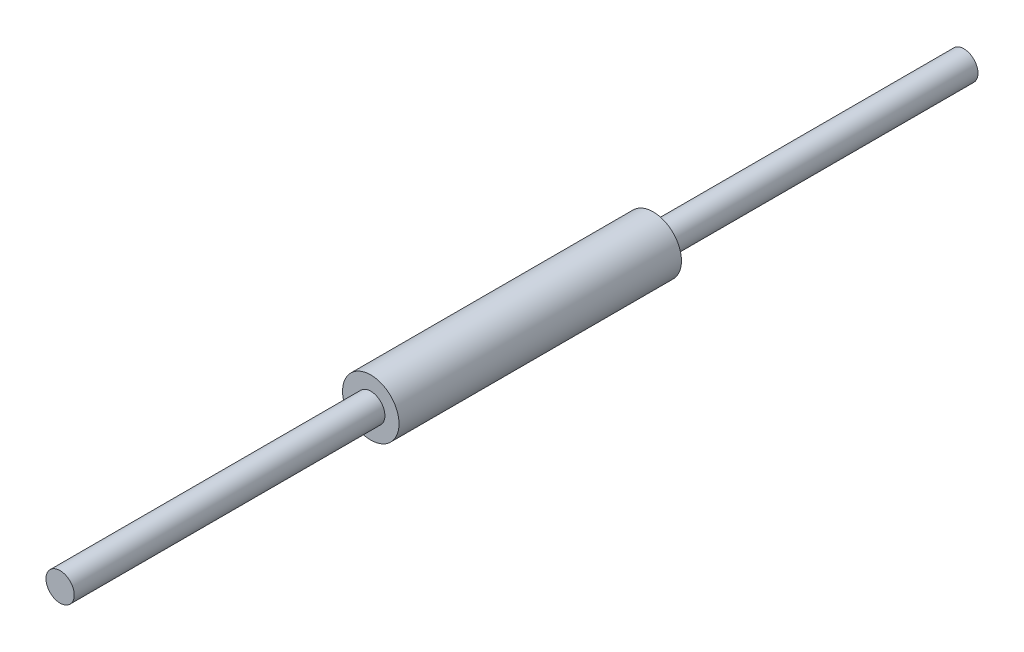
ISO-10303-21;
HEADER;
FILE_DESCRIPTION(('STEP AP214'),'2;1');
FILE_NAME('part.step','',(''),(''),'','','');
FILE_SCHEMA(('AUTOMOTIVE_DESIGN { 1 0 10303 214 1 1 1 1 }'));
ENDSEC;
DATA;
#1=APPLICATION_CONTEXT('core data for automotive mechanical design processes');
#2=APPLICATION_PROTOCOL_DEFINITION('international standard','automotive_design',2000,#1);
#3=PRODUCT_CONTEXT('',#1,'mechanical');
#4=PRODUCT('Part','Part','',(#3));
#5=PRODUCT_RELATED_PRODUCT_CATEGORY('part','',(#4));
#6=PRODUCT_DEFINITION_FORMATION('','',#4);
#7=PRODUCT_DEFINITION_CONTEXT('part definition',#1,'design');
#8=PRODUCT_DEFINITION('design','',#6,#7);
#9=PRODUCT_DEFINITION_SHAPE('','',#8);
#10=(LENGTH_UNIT() NAMED_UNIT(*) SI_UNIT(.MILLI.,.METRE.));
#11=(NAMED_UNIT(*) PLANE_ANGLE_UNIT() SI_UNIT($,.RADIAN.));
#12=(NAMED_UNIT(*) SI_UNIT($,.STERADIAN.) SOLID_ANGLE_UNIT());
#13=UNCERTAINTY_MEASURE_WITH_UNIT(LENGTH_MEASURE(1.E-05),#10,'distance_accuracy_value','');
#14=(GEOMETRIC_REPRESENTATION_CONTEXT(3) GLOBAL_UNCERTAINTY_ASSIGNED_CONTEXT((#13)) GLOBAL_UNIT_ASSIGNED_CONTEXT((#10,
#11,#12)) REPRESENTATION_CONTEXT('',''));
#15=CARTESIAN_POINT('',(0.,0.,0.));
#16=DIRECTION('',(0.,0.,1.));
#17=DIRECTION('',(1.,0.,0.));
#18=AXIS2_PLACEMENT_3D('',#15,#16,#17);
#19=CARTESIAN_POINT('',(0.,0.,125.));
#20=DIRECTION('',(0.,0.,-1.));
#21=DIRECTION('',(-1.,0.,0.));
#22=AXIS2_PLACEMENT_3D('',#19,#20,#21);
#23=CYLINDRICAL_SURFACE('',#22,25.);
#24=CARTESIAN_POINT('',(0.,0.,125.));
#25=DIRECTION('',(0.,0.,1.));
#26=DIRECTION('',(1.,0.,0.));
#27=AXIS2_PLACEMENT_3D('',#24,#25,#26);
#28=CIRCLE('',#27,25.);
#29=CARTESIAN_POINT('',(25.,0.,125.));
#30=VERTEX_POINT('',#29);
#31=EDGE_CURVE('E47',#30,#30,#28,.T.);
#32=ORIENTED_EDGE('',*,*,#31,.F.);
#33=EDGE_LOOP('',(#32));
#34=FACE_BOUND('',#33,.T.);
#35=CARTESIAN_POINT('',(0.,0.,-125.));
#36=DIRECTION('',(0.,0.,1.));
#37=DIRECTION('',(1.,0.,0.));
#38=AXIS2_PLACEMENT_3D('',#35,#36,#37);
#39=CIRCLE('',#38,25.);
#40=CARTESIAN_POINT('',(25.,0.,-125.));
#41=VERTEX_POINT('',#40);
#42=EDGE_CURVE('E51',#41,#41,#39,.T.);
#43=ORIENTED_EDGE('',*,*,#42,.T.);
#44=EDGE_LOOP('',(#43));
#45=FACE_BOUND('',#44,.T.);
#46=ADVANCED_FACE('F41',(#34,#45),#23,.T.);
#47=CARTESIAN_POINT('',(0.,0.,125.));
#48=DIRECTION('',(0.,0.,1.));
#49=DIRECTION('',(1.,0.,0.));
#50=AXIS2_PLACEMENT_3D('',#47,#48,#49);
#51=PLANE('',#50);
#52=CARTESIAN_POINT('',(0.,0.,125.));
#53=DIRECTION('',(0.,0.,1.));
#54=DIRECTION('',(1.,0.,0.));
#55=AXIS2_PLACEMENT_3D('',#52,#53,#54);
#56=CIRCLE('',#55,12.5);
#57=CARTESIAN_POINT('',(12.5,0.,125.));
#58=VERTEX_POINT('',#57);
#59=EDGE_CURVE('E56',#58,#58,#56,.F.);
#60=ORIENTED_EDGE('',*,*,#59,.T.);
#61=EDGE_LOOP('',(#60));
#62=FACE_BOUND('',#61,.T.);
#63=ORIENTED_EDGE('',*,*,#31,.T.);
#64=EDGE_LOOP('',(#63));
#65=FACE_BOUND('',#64,.T.);
#66=ADVANCED_FACE('F85',(#62,#65),#51,.T.);
#67=CARTESIAN_POINT('',(0.,0.,-125.));
#68=DIRECTION('',(0.,0.,1.));
#69=DIRECTION('',(1.,0.,0.));
#70=AXIS2_PLACEMENT_3D('',#67,#68,#69);
#71=PLANE('',#70);
#72=CARTESIAN_POINT('',(0.,0.,-125.));
#73=DIRECTION('',(0.,0.,1.));
#74=DIRECTION('',(1.,0.,0.));
#75=AXIS2_PLACEMENT_3D('',#72,#73,#74);
#76=CIRCLE('',#75,12.5);
#77=CARTESIAN_POINT('',(12.5,0.,-125.));
#78=VERTEX_POINT('',#77);
#79=EDGE_CURVE('E10',#78,#78,#76,.F.);
#80=ORIENTED_EDGE('',*,*,#79,.F.);
#81=EDGE_LOOP('',(#80));
#82=FACE_BOUND('',#81,.T.);
#83=ORIENTED_EDGE('',*,*,#42,.F.);
#84=EDGE_LOOP('',(#83));
#85=FACE_BOUND('',#84,.T.);
#86=ADVANCED_FACE('F90',(#82,#85),#71,.F.);
#87=CARTESIAN_POINT('',(0.,0.,-400.));
#88=DIRECTION('',(0.,0.,1.));
#89=DIRECTION('',(1.,0.,0.));
#90=AXIS2_PLACEMENT_3D('',#87,#88,#89);
#91=PLANE('',#90);
#92=CARTESIAN_POINT('',(0.,0.,-400.));
#93=DIRECTION('',(0.,0.,1.));
#94=DIRECTION('',(1.,0.,0.));
#95=AXIS2_PLACEMENT_3D('',#92,#93,#94);
#96=CIRCLE('',#95,12.5);
#97=CARTESIAN_POINT('',(12.5,0.,-400.));
#98=VERTEX_POINT('',#97);
#99=EDGE_CURVE('E61',#98,#98,#96,.T.);
#100=ORIENTED_EDGE('',*,*,#99,.F.);
#101=EDGE_LOOP('',(#100));
#102=FACE_BOUND('',#101,.T.);
#103=ADVANCED_FACE('F79',(#102),#91,.F.);
#104=CARTESIAN_POINT('',(0.,0.,400.));
#105=DIRECTION('',(0.,0.,-1.));
#106=DIRECTION('',(-1.,0.,0.));
#107=AXIS2_PLACEMENT_3D('',#104,#105,#106);
#108=CYLINDRICAL_SURFACE('',#107,12.5);
#109=ORIENTED_EDGE('',*,*,#99,.T.);
#110=EDGE_LOOP('',(#109));
#111=FACE_BOUND('',#110,.T.);
#112=ORIENTED_EDGE('',*,*,#79,.T.);
#113=EDGE_LOOP('',(#112));
#114=FACE_BOUND('',#113,.T.);
#115=ADVANCED_FACE('F71',(#111,#114),#108,.T.);
#116=ORIENTED_EDGE('',*,*,#59,.F.);
#117=EDGE_LOOP('',(#116));
#118=FACE_BOUND('',#117,.T.);
#119=CARTESIAN_POINT('',(0.,0.,400.));
#120=DIRECTION('',(0.,0.,1.));
#121=DIRECTION('',(1.,0.,0.));
#122=AXIS2_PLACEMENT_3D('',#119,#120,#121);
#123=CIRCLE('',#122,12.5);
#124=CARTESIAN_POINT('',(12.5,0.,400.));
#125=VERTEX_POINT('',#124);
#126=EDGE_CURVE('E60',#125,#125,#123,.T.);
#127=ORIENTED_EDGE('',*,*,#126,.F.);
#128=EDGE_LOOP('',(#127));
#129=FACE_BOUND('',#128,.T.);
#130=ADVANCED_FACE('F69',(#118,#129),#108,.T.);
#131=CARTESIAN_POINT('',(0.,0.,400.));
#132=DIRECTION('',(0.,0.,1.));
#133=DIRECTION('',(1.,0.,0.));
#134=AXIS2_PLACEMENT_3D('',#131,#132,#133);
#135=PLANE('',#134);
#136=ORIENTED_EDGE('',*,*,#126,.T.);
#137=EDGE_LOOP('',(#136));
#138=FACE_BOUND('',#137,.T.);
#139=ADVANCED_FACE('F67',(#138),#135,.T.);
#140=CLOSED_SHELL('',(#46,#66,#86,#103,#115,#130,#139));
#141=MANIFOLD_SOLID_BREP('B2',#140);
#142=ADVANCED_BREP_SHAPE_REPRESENTATION('',(#18,#141),#14);
#143=SHAPE_DEFINITION_REPRESENTATION(#9,#142);
ENDSEC;
END-ISO-10303-21;
